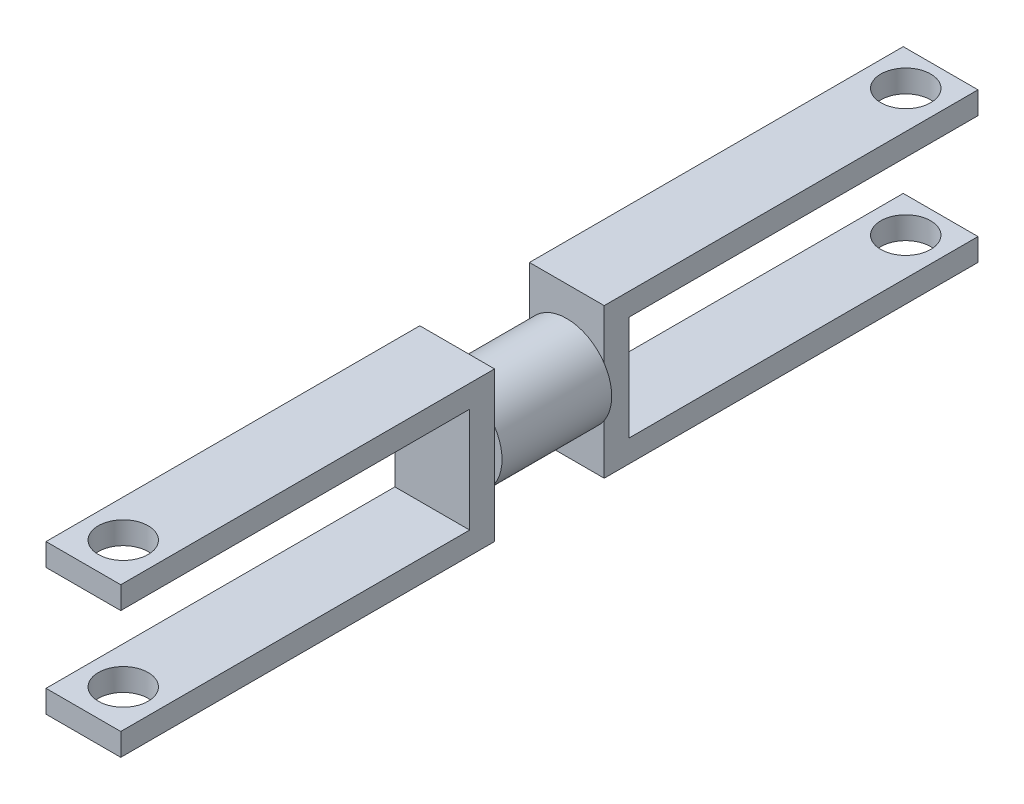
ISO-10303-21;
HEADER;
FILE_DESCRIPTION(('STEP AP214'),'2;1');
FILE_NAME('part.step','',(''),(''),'','','');
FILE_SCHEMA(('AUTOMOTIVE_DESIGN { 1 0 10303 214 1 1 1 1 }'));
ENDSEC;
DATA;
#1=APPLICATION_CONTEXT('core data for automotive mechanical design processes');
#2=APPLICATION_PROTOCOL_DEFINITION('international standard','automotive_design',2000,#1);
#3=PRODUCT_CONTEXT('',#1,'mechanical');
#4=PRODUCT('Part','Part','',(#3));
#5=PRODUCT_RELATED_PRODUCT_CATEGORY('part','',(#4));
#6=PRODUCT_DEFINITION_FORMATION('','',#4);
#7=PRODUCT_DEFINITION_CONTEXT('part definition',#1,'design');
#8=PRODUCT_DEFINITION('design','',#6,#7);
#9=PRODUCT_DEFINITION_SHAPE('','',#8);
#10=(LENGTH_UNIT() NAMED_UNIT(*) SI_UNIT(.MILLI.,.METRE.));
#11=(NAMED_UNIT(*) PLANE_ANGLE_UNIT() SI_UNIT($,.RADIAN.));
#12=(NAMED_UNIT(*) SI_UNIT($,.STERADIAN.) SOLID_ANGLE_UNIT());
#13=UNCERTAINTY_MEASURE_WITH_UNIT(LENGTH_MEASURE(1.E-05),#10,'distance_accuracy_value','');
#14=(GEOMETRIC_REPRESENTATION_CONTEXT(3) GLOBAL_UNCERTAINTY_ASSIGNED_CONTEXT((#13)) GLOBAL_UNIT_ASSIGNED_CONTEXT((#10,
#11,#12)) REPRESENTATION_CONTEXT('',''));
#15=CARTESIAN_POINT('',(0.,0.,0.));
#16=DIRECTION('',(0.,0.,1.));
#17=DIRECTION('',(1.,0.,0.));
#18=AXIS2_PLACEMENT_3D('',#15,#16,#17);
#19=CARTESIAN_POINT('',(0.,0.,38.8));
#20=DIRECTION('',(0.,0.,-1.));
#21=DIRECTION('',(-1.,0.,0.));
#22=AXIS2_PLACEMENT_3D('',#19,#20,#21);
#23=PLANE('',#22);
#24=DIRECTION('',(0.,-1.,0.));
#25=VECTOR('',#24,1.);
#26=CARTESIAN_POINT('',(-3.,-6.,38.8));
#27=LINE('',#26,#25);
#28=CARTESIAN_POINT('',(-3.,6.,38.8));
#29=VERTEX_POINT('',#28);
#30=CARTESIAN_POINT('',(-3.00000000000026,4.19999999999998,38.8));
#31=VERTEX_POINT('',#30);
#32=EDGE_CURVE('E313',#29,#31,#27,.T.);
#33=ORIENTED_EDGE('',*,*,#32,.T.);
#34=DIRECTION('',(-1.,0.,0.));
#35=VECTOR('',#34,1.);
#36=CARTESIAN_POINT('',(-3.00000000000026,4.19999999999998,38.8));
#37=LINE('',#36,#35);
#38=CARTESIAN_POINT('',(3.00000000000026,4.19999999999998,38.8));
#39=VERTEX_POINT('',#38);
#40=EDGE_CURVE('E199',#39,#31,#37,.T.);
#41=ORIENTED_EDGE('',*,*,#40,.F.);
#42=DIRECTION('',(0.,1.,0.));
#43=VECTOR('',#42,1.);
#44=CARTESIAN_POINT('',(3.,-6.,38.8));
#45=LINE('',#44,#43);
#46=CARTESIAN_POINT('',(3.,6.,38.8));
#47=VERTEX_POINT('',#46);
#48=EDGE_CURVE('E310',#39,#47,#45,.T.);
#49=ORIENTED_EDGE('',*,*,#48,.T.);
#50=DIRECTION('',(-1.,0.,0.));
#51=VECTOR('',#50,1.);
#52=CARTESIAN_POINT('',(-3.,6.,38.8));
#53=LINE('',#52,#51);
#54=EDGE_CURVE('E309',#47,#29,#53,.T.);
#55=ORIENTED_EDGE('',*,*,#54,.T.);
#56=EDGE_LOOP('',(#33,#41,#49,#55));
#57=FACE_BOUND('',#56,.T.);
#58=ADVANCED_FACE('F39',(#57),#23,.F.);
#59=CARTESIAN_POINT('',(0.,-24.,35.6));
#60=DIRECTION('',(0.,1.,0.));
#61=DIRECTION('',(0.,0.,1.));
#62=AXIS2_PLACEMENT_3D('',#59,#60,#61);
#63=CYLINDRICAL_SURFACE('',#62,2.);
#64=CARTESIAN_POINT('',(0.,4.19999999999998,35.6));
#65=DIRECTION('',(0.,1.,0.));
#66=DIRECTION('',(0.,0.,1.));
#67=AXIS2_PLACEMENT_3D('',#64,#65,#66);
#68=CIRCLE('',#67,2.);
#69=CARTESIAN_POINT('',(0.,4.19999999999998,37.6));
#70=VERTEX_POINT('',#69);
#71=EDGE_CURVE('E43',#70,#70,#68,.F.);
#72=ORIENTED_EDGE('',*,*,#71,.T.);
#73=EDGE_LOOP('',(#72));
#74=FACE_BOUND('',#73,.T.);
#75=CARTESIAN_POINT('',(0.,6.,35.6));
#76=DIRECTION('',(0.,1.,0.));
#77=DIRECTION('',(0.,0.,1.));
#78=AXIS2_PLACEMENT_3D('',#75,#76,#77);
#79=CIRCLE('',#78,2.);
#80=CARTESIAN_POINT('',(0.,6.,37.6));
#81=VERTEX_POINT('',#80);
#82=EDGE_CURVE('E249',#81,#81,#79,.T.);
#83=ORIENTED_EDGE('',*,*,#82,.T.);
#84=EDGE_LOOP('',(#83));
#85=FACE_BOUND('',#84,.T.);
#86=ADVANCED_FACE('F494',(#74,#85),#63,.F.);
#87=CARTESIAN_POINT('',(0.,0.,-30.));
#88=DIRECTION('',(0.,0.,-1.));
#89=DIRECTION('',(-1.,0.,0.));
#90=AXIS2_PLACEMENT_3D('',#87,#88,#89);
#91=PLANE('',#90);
#92=DIRECTION('',(1.,0.,0.));
#93=VECTOR('',#92,1.);
#94=CARTESIAN_POINT('',(3.,4.2,-30.));
#95=LINE('',#94,#93);
#96=CARTESIAN_POINT('',(-3.,4.2,-30.));
#97=VERTEX_POINT('',#96);
#98=CARTESIAN_POINT('',(3.,4.2,-30.));
#99=VERTEX_POINT('',#98);
#100=EDGE_CURVE('E219',#97,#99,#95,.T.);
#101=ORIENTED_EDGE('',*,*,#100,.F.);
#102=DIRECTION('',(0.,1.,0.));
#103=VECTOR('',#102,1.);
#104=CARTESIAN_POINT('',(-3.,6.,-30.));
#105=LINE('',#104,#103);
#106=CARTESIAN_POINT('',(-3.,6.,-30.));
#107=VERTEX_POINT('',#106);
#108=EDGE_CURVE('E264',#97,#107,#105,.T.);
#109=ORIENTED_EDGE('',*,*,#108,.T.);
#110=DIRECTION('',(1.,0.,0.));
#111=VECTOR('',#110,1.);
#112=CARTESIAN_POINT('',(3.,6.,-30.));
#113=LINE('',#112,#111);
#114=CARTESIAN_POINT('',(3.,6.,-30.));
#115=VERTEX_POINT('',#114);
#116=EDGE_CURVE('E263',#107,#115,#113,.T.);
#117=ORIENTED_EDGE('',*,*,#116,.T.);
#118=DIRECTION('',(0.,-1.,0.));
#119=VECTOR('',#118,1.);
#120=CARTESIAN_POINT('',(3.,6.,-30.));
#121=LINE('',#120,#119);
#122=EDGE_CURVE('E268',#115,#99,#121,.T.);
#123=ORIENTED_EDGE('',*,*,#122,.T.);
#124=EDGE_LOOP('',(#101,#109,#117,#123));
#125=FACE_BOUND('',#124,.T.);
#126=ADVANCED_FACE('F431',(#125),#91,.T.);
#127=CARTESIAN_POINT('',(0.,-24.,-27.2));
#128=DIRECTION('',(0.,1.,0.));
#129=DIRECTION('',(0.,0.,1.));
#130=AXIS2_PLACEMENT_3D('',#127,#128,#129);
#131=CYLINDRICAL_SURFACE('',#130,2.);
#132=CARTESIAN_POINT('',(0.,4.2,-27.2));
#133=DIRECTION('',(0.,1.,0.));
#134=DIRECTION('',(0.,0.,1.));
#135=AXIS2_PLACEMENT_3D('',#132,#133,#134);
#136=CIRCLE('',#135,2.);
#137=CARTESIAN_POINT('',(0.,4.2,-25.2));
#138=VERTEX_POINT('',#137);
#139=EDGE_CURVE('E258',#138,#138,#136,.F.);
#140=ORIENTED_EDGE('',*,*,#139,.T.);
#141=EDGE_LOOP('',(#140));
#142=FACE_BOUND('',#141,.T.);
#143=CARTESIAN_POINT('',(0.,6.,-27.2));
#144=DIRECTION('',(0.,1.,0.));
#145=DIRECTION('',(0.,0.,1.));
#146=AXIS2_PLACEMENT_3D('',#143,#144,#145);
#147=CIRCLE('',#146,2.);
#148=CARTESIAN_POINT('',(0.,6.,-25.2));
#149=VERTEX_POINT('',#148);
#150=EDGE_CURVE('E254',#149,#149,#147,.T.);
#151=ORIENTED_EDGE('',*,*,#150,.T.);
#152=EDGE_LOOP('',(#151));
#153=FACE_BOUND('',#152,.T.);
#154=ADVANCED_FACE('F597',(#142,#153),#131,.F.);
#155=CARTESIAN_POINT('',(0.,0.,0.));
#156=DIRECTION('',(0.,0.,1.));
#157=DIRECTION('',(1.,0.,0.));
#158=AXIS2_PLACEMENT_3D('',#155,#156,#157);
#159=PLANE('',#158);
#160=DIRECTION('',(0.,1.,0.));
#161=VECTOR('',#160,1.);
#162=CARTESIAN_POINT('',(-3.,6.,0.));
#163=LINE('',#162,#161);
#164=CARTESIAN_POINT('',(-3.,-1.98997487421324,0.));
#165=VERTEX_POINT('',#164);
#166=CARTESIAN_POINT('',(-3.,1.98997487421324,0.));
#167=VERTEX_POINT('',#166);
#168=EDGE_CURVE('E11',#165,#167,#163,.T.);
#169=ORIENTED_EDGE('',*,*,#168,.F.);
#170=CARTESIAN_POINT('',(0.,0.,0.));
#171=DIRECTION('',(0.,0.,1.));
#172=DIRECTION('',(1.,0.,0.));
#173=AXIS2_PLACEMENT_3D('',#170,#171,#172);
#174=CIRCLE('',#173,3.6);
#175=EDGE_CURVE('E364',#167,#165,#174,.T.);
#176=ORIENTED_EDGE('',*,*,#175,.F.);
#177=EDGE_LOOP('',(#169,#176));
#178=FACE_BOUND('',#177,.T.);
#179=ADVANCED_FACE('F533',(#178),#159,.F.);
#180=DIRECTION('',(0.,-1.,0.));
#181=VECTOR('',#180,1.);
#182=CARTESIAN_POINT('',(3.,6.,0.));
#183=LINE('',#182,#181);
#184=CARTESIAN_POINT('',(3.,1.98997487421324,0.));
#185=VERTEX_POINT('',#184);
#186=CARTESIAN_POINT('',(3.,-1.98997487421324,0.));
#187=VERTEX_POINT('',#186);
#188=EDGE_CURVE('E49',#185,#187,#183,.T.);
#189=ORIENTED_EDGE('',*,*,#188,.F.);
#190=EDGE_CURVE('E353',#187,#185,#174,.T.);
#191=ORIENTED_EDGE('',*,*,#190,.F.);
#192=EDGE_LOOP('',(#189,#191));
#193=FACE_BOUND('',#192,.T.);
#194=ADVANCED_FACE('F527',(#193),#159,.F.);
#195=CARTESIAN_POINT('',(0.,0.,8.8));
#196=DIRECTION('',(0.,0.,1.));
#197=DIRECTION('',(1.,0.,0.));
#198=AXIS2_PLACEMENT_3D('',#195,#196,#197);
#199=PLANE('',#198);
#200=DIRECTION('',(0.,1.,0.));
#201=VECTOR('',#200,1.);
#202=CARTESIAN_POINT('',(3.,-6.,8.8));
#203=LINE('',#202,#201);
#204=CARTESIAN_POINT('',(3.,-1.98997487421324,8.8));
#205=VERTEX_POINT('',#204);
#206=CARTESIAN_POINT('',(3.,1.98997487421324,8.8));
#207=VERTEX_POINT('',#206);
#208=EDGE_CURVE('E326',#205,#207,#203,.T.);
#209=ORIENTED_EDGE('',*,*,#208,.F.);
#210=CARTESIAN_POINT('',(0.,0.,8.8));
#211=DIRECTION('',(0.,0.,1.));
#212=DIRECTION('',(1.,0.,0.));
#213=AXIS2_PLACEMENT_3D('',#210,#211,#212);
#214=CIRCLE('',#213,3.6);
#215=EDGE_CURVE('E359',#205,#207,#214,.T.);
#216=ORIENTED_EDGE('',*,*,#215,.T.);
#217=EDGE_LOOP('',(#209,#216));
#218=FACE_BOUND('',#217,.T.);
#219=ADVANCED_FACE('F525',(#218),#199,.T.);
#220=CARTESIAN_POINT('',(0.,0.,8.8));
#221=DIRECTION('',(0.,0.,-1.));
#222=DIRECTION('',(-1.,0.,0.));
#223=AXIS2_PLACEMENT_3D('',#220,#221,#222);
#224=CYLINDRICAL_SURFACE('',#223,3.6);
#225=CARTESIAN_POINT('',(-3.,1.98997487421324,8.8));
#226=VERTEX_POINT('',#225);
#227=EDGE_CURVE('E354',#207,#226,#214,.T.);
#228=ORIENTED_EDGE('',*,*,#227,.F.);
#229=ORIENTED_EDGE('',*,*,#215,.F.);
#230=CARTESIAN_POINT('',(-3.,-1.98997487421324,8.8));
#231=VERTEX_POINT('',#230);
#232=EDGE_CURVE('E485',#231,#205,#214,.T.);
#233=ORIENTED_EDGE('',*,*,#232,.F.);
#234=EDGE_CURVE('E358',#226,#231,#214,.T.);
#235=ORIENTED_EDGE('',*,*,#234,.F.);
#236=EDGE_LOOP('',(#228,#229,#233,#235));
#237=FACE_BOUND('',#236,.T.);
#238=EDGE_CURVE('E360',#185,#167,#174,.T.);
#239=ORIENTED_EDGE('',*,*,#238,.T.);
#240=ORIENTED_EDGE('',*,*,#175,.T.);
#241=EDGE_CURVE('E459',#165,#187,#174,.T.);
#242=ORIENTED_EDGE('',*,*,#241,.T.);
#243=ORIENTED_EDGE('',*,*,#190,.T.);
#244=EDGE_LOOP('',(#239,#240,#242,#243));
#245=FACE_BOUND('',#244,.T.);
#246=ADVANCED_FACE('F41',(#237,#245),#224,.T.);
#247=DIRECTION('',(0.,-1.,0.));
#248=VECTOR('',#247,1.);
#249=CARTESIAN_POINT('',(-3.,-6.,8.8));
#250=LINE('',#249,#248);
#251=EDGE_CURVE('E335',#226,#231,#250,.T.);
#252=ORIENTED_EDGE('',*,*,#251,.F.);
#253=ORIENTED_EDGE('',*,*,#234,.T.);
#254=EDGE_LOOP('',(#252,#253));
#255=FACE_BOUND('',#254,.T.);
#256=ADVANCED_FACE('F478',(#255),#199,.T.);
#257=CARTESIAN_POINT('',(0.,0.,8.8));
#258=DIRECTION('',(0.,0.,-1.));
#259=DIRECTION('',(-1.,0.,0.));
#260=AXIS2_PLACEMENT_3D('',#257,#258,#259);
#261=PLANE('',#260);
#262=CARTESIAN_POINT('',(3.,6.,8.8));
#263=VERTEX_POINT('',#262);
#264=EDGE_CURVE('E304',#207,#263,#203,.T.);
#265=ORIENTED_EDGE('',*,*,#264,.F.);
#266=ORIENTED_EDGE('',*,*,#227,.T.);
#267=CARTESIAN_POINT('',(-3.,6.,8.8));
#268=VERTEX_POINT('',#267);
#269=EDGE_CURVE('E330',#268,#226,#250,.T.);
#270=ORIENTED_EDGE('',*,*,#269,.F.);
#271=DIRECTION('',(-1.,0.,0.));
#272=VECTOR('',#271,1.);
#273=CARTESIAN_POINT('',(-3.,6.,8.8));
#274=LINE('',#273,#272);
#275=EDGE_CURVE('E325',#263,#268,#274,.T.);
#276=ORIENTED_EDGE('',*,*,#275,.F.);
#277=EDGE_LOOP('',(#265,#266,#270,#276));
#278=FACE_BOUND('',#277,.T.);
#279=ADVANCED_FACE('F488',(#278),#261,.T.);
#280=CARTESIAN_POINT('',(3.,-6.,38.8));
#281=DIRECTION('',(-1.,0.,0.));
#282=DIRECTION('',(0.,0.,1.));
#283=AXIS2_PLACEMENT_3D('',#280,#281,#282);
#284=PLANE('',#283);
#285=ORIENTED_EDGE('',*,*,#48,.F.);
#286=DIRECTION('',(0.,0.,1.));
#287=VECTOR('',#286,1.);
#288=CARTESIAN_POINT('',(3.00000000000026,4.19999999999998,10.8));
#289=LINE('',#288,#287);
#290=CARTESIAN_POINT('',(3.00000000000026,4.19999999999998,10.8));
#291=VERTEX_POINT('',#290);
#292=EDGE_CURVE('E209',#291,#39,#289,.T.);
#293=ORIENTED_EDGE('',*,*,#292,.F.);
#294=DIRECTION('',(0.,1.,0.));
#295=VECTOR('',#294,1.);
#296=CARTESIAN_POINT('',(3.00000000000026,-4.19999999999998,10.8));
#297=LINE('',#296,#295);
#298=CARTESIAN_POINT('',(3.00000000000026,-4.19999999999998,10.8));
#299=VERTEX_POINT('',#298);
#300=EDGE_CURVE('E188',#299,#291,#297,.T.);
#301=ORIENTED_EDGE('',*,*,#300,.F.);
#302=DIRECTION('',(0.,0.,1.));
#303=VECTOR('',#302,1.);
#304=CARTESIAN_POINT('',(3.00000000000026,-4.19999999999998,10.8));
#305=LINE('',#304,#303);
#306=CARTESIAN_POINT('',(3.00000000000026,-4.19999999999998,38.8));
#307=VERTEX_POINT('',#306);
#308=EDGE_CURVE('E184',#299,#307,#305,.T.);
#309=ORIENTED_EDGE('',*,*,#308,.T.);
#310=CARTESIAN_POINT('',(3.,-6.,38.8));
#311=VERTEX_POINT('',#310);
#312=EDGE_CURVE('E305',#311,#307,#45,.T.);
#313=ORIENTED_EDGE('',*,*,#312,.F.);
#314=DIRECTION('',(0.,0.,-1.));
#315=VECTOR('',#314,1.);
#316=CARTESIAN_POINT('',(3.,-6.,38.8));
#317=LINE('',#316,#315);
#318=CARTESIAN_POINT('',(3.,-6.,8.8));
#319=VERTEX_POINT('',#318);
#320=EDGE_CURVE('E320',#311,#319,#317,.T.);
#321=ORIENTED_EDGE('',*,*,#320,.T.);
#322=EDGE_CURVE('E321',#319,#205,#203,.T.);
#323=ORIENTED_EDGE('',*,*,#322,.T.);
#324=ORIENTED_EDGE('',*,*,#208,.T.);
#325=ORIENTED_EDGE('',*,*,#264,.T.);
#326=DIRECTION('',(0.,0.,-1.));
#327=VECTOR('',#326,1.);
#328=CARTESIAN_POINT('',(3.,6.,38.8));
#329=LINE('',#328,#327);
#330=EDGE_CURVE('E349',#47,#263,#329,.T.);
#331=ORIENTED_EDGE('',*,*,#330,.F.);
#332=EDGE_LOOP('',(#285,#293,#301,#309,#313,#321,#323,#324,#325,#331));
#333=FACE_BOUND('',#332,.T.);
#334=ADVANCED_FACE('F403',(#333),#284,.F.);
#335=CARTESIAN_POINT('',(-3.,6.,38.8));
#336=DIRECTION('',(0.,-1.,0.));
#337=DIRECTION('',(0.,0.,-1.));
#338=AXIS2_PLACEMENT_3D('',#335,#336,#337);
#339=PLANE('',#338);
#340=ORIENTED_EDGE('',*,*,#82,.F.);
#341=EDGE_LOOP('',(#340));
#342=FACE_BOUND('',#341,.T.);
#343=ORIENTED_EDGE('',*,*,#275,.T.);
#344=DIRECTION('',(0.,0.,-1.));
#345=VECTOR('',#344,1.);
#346=CARTESIAN_POINT('',(-3.,6.,38.8));
#347=LINE('',#346,#345);
#348=EDGE_CURVE('E345',#29,#268,#347,.T.);
#349=ORIENTED_EDGE('',*,*,#348,.F.);
#350=ORIENTED_EDGE('',*,*,#54,.F.);
#351=ORIENTED_EDGE('',*,*,#330,.T.);
#352=EDGE_LOOP('',(#343,#349,#350,#351));
#353=FACE_BOUND('',#352,.T.);
#354=ADVANCED_FACE('F492',(#342,#353),#339,.F.);
#355=CARTESIAN_POINT('',(-3.,-6.,38.8));
#356=DIRECTION('',(1.,0.,0.));
#357=DIRECTION('',(0.,0.,-1.));
#358=AXIS2_PLACEMENT_3D('',#355,#356,#357);
#359=PLANE('',#358);
#360=DIRECTION('',(0.,-1.,0.));
#361=VECTOR('',#360,1.);
#362=CARTESIAN_POINT('',(-3.00000000000026,-4.19999999999998,10.8));
#363=LINE('',#362,#361);
#364=CARTESIAN_POINT('',(-3.00000000000026,4.19999999999998,10.8));
#365=VERTEX_POINT('',#364);
#366=CARTESIAN_POINT('',(-3.00000000000026,-4.19999999999998,10.8));
#367=VERTEX_POINT('',#366);
#368=EDGE_CURVE('E189',#365,#367,#363,.T.);
#369=ORIENTED_EDGE('',*,*,#368,.F.);
#370=DIRECTION('',(0.,0.,1.));
#371=VECTOR('',#370,1.);
#372=CARTESIAN_POINT('',(-3.00000000000026,4.19999999999998,10.8));
#373=LINE('',#372,#371);
#374=EDGE_CURVE('E380',#365,#31,#373,.T.);
#375=ORIENTED_EDGE('',*,*,#374,.T.);
#376=ORIENTED_EDGE('',*,*,#32,.F.);
#377=ORIENTED_EDGE('',*,*,#348,.T.);
#378=ORIENTED_EDGE('',*,*,#269,.T.);
#379=ORIENTED_EDGE('',*,*,#251,.T.);
#380=CARTESIAN_POINT('',(-3.,-6.,8.8));
#381=VERTEX_POINT('',#380);
#382=EDGE_CURVE('E329',#231,#381,#250,.T.);
#383=ORIENTED_EDGE('',*,*,#382,.T.);
#384=DIRECTION('',(0.,0.,-1.));
#385=VECTOR('',#384,1.);
#386=CARTESIAN_POINT('',(-3.,-6.,38.8));
#387=LINE('',#386,#385);
#388=CARTESIAN_POINT('',(-3.,-6.,38.8));
#389=VERTEX_POINT('',#388);
#390=EDGE_CURVE('E341',#389,#381,#387,.T.);
#391=ORIENTED_EDGE('',*,*,#390,.F.);
#392=CARTESIAN_POINT('',(-3.,-4.19999999999998,38.8));
#393=VERTEX_POINT('',#392);
#394=EDGE_CURVE('E204',#393,#389,#27,.T.);
#395=ORIENTED_EDGE('',*,*,#394,.F.);
#396=DIRECTION('',(0.,0.,1.));
#397=VECTOR('',#396,1.);
#398=CARTESIAN_POINT('',(-3.00000000000026,-4.19999999999998,10.8));
#399=LINE('',#398,#397);
#400=EDGE_CURVE('E59',#367,#393,#399,.T.);
#401=ORIENTED_EDGE('',*,*,#400,.F.);
#402=EDGE_LOOP('',(#369,#375,#376,#377,#378,#379,#383,#391,#395,#401));
#403=FACE_BOUND('',#402,.T.);
#404=ADVANCED_FACE('F202',(#403),#359,.F.);
#405=CARTESIAN_POINT('',(-3.,-6.,38.8));
#406=DIRECTION('',(0.,1.,0.));
#407=DIRECTION('',(0.,0.,1.));
#408=AXIS2_PLACEMENT_3D('',#405,#406,#407);
#409=PLANE('',#408);
#410=CARTESIAN_POINT('',(0.,-6.,35.6));
#411=DIRECTION('',(0.,1.,0.));
#412=DIRECTION('',(0.,0.,1.));
#413=AXIS2_PLACEMENT_3D('',#410,#411,#412);
#414=CIRCLE('',#413,2.);
#415=CARTESIAN_POINT('',(0.,-6.,37.6));
#416=VERTEX_POINT('',#415);
#417=EDGE_CURVE('E368',#416,#416,#414,.T.);
#418=ORIENTED_EDGE('',*,*,#417,.T.);
#419=EDGE_LOOP('',(#418));
#420=FACE_BOUND('',#419,.T.);
#421=DIRECTION('',(1.,0.,0.));
#422=VECTOR('',#421,1.);
#423=CARTESIAN_POINT('',(-3.,-6.,8.8));
#424=LINE('',#423,#422);
#425=EDGE_CURVE('E334',#381,#319,#424,.T.);
#426=ORIENTED_EDGE('',*,*,#425,.T.);
#427=ORIENTED_EDGE('',*,*,#320,.F.);
#428=DIRECTION('',(1.,0.,0.));
#429=VECTOR('',#428,1.);
#430=CARTESIAN_POINT('',(-3.,-6.,38.8));
#431=LINE('',#430,#429);
#432=EDGE_CURVE('E317',#389,#311,#431,.T.);
#433=ORIENTED_EDGE('',*,*,#432,.F.);
#434=ORIENTED_EDGE('',*,*,#390,.T.);
#435=EDGE_LOOP('',(#426,#427,#433,#434));
#436=FACE_BOUND('',#435,.T.);
#437=ADVANCED_FACE('F507',(#420,#436),#409,.F.);
#438=ORIENTED_EDGE('',*,*,#312,.T.);
#439=DIRECTION('',(1.,0.,0.));
#440=VECTOR('',#439,1.);
#441=CARTESIAN_POINT('',(-3.00000000000026,-4.19999999999998,38.8));
#442=LINE('',#441,#440);
#443=EDGE_CURVE('E392',#393,#307,#442,.T.);
#444=ORIENTED_EDGE('',*,*,#443,.F.);
#445=ORIENTED_EDGE('',*,*,#394,.T.);
#446=ORIENTED_EDGE('',*,*,#432,.T.);
#447=EDGE_LOOP('',(#438,#444,#445,#446));
#448=FACE_BOUND('',#447,.T.);
#449=ADVANCED_FACE('F496',(#448),#23,.F.);
#450=ORIENTED_EDGE('',*,*,#382,.F.);
#451=ORIENTED_EDGE('',*,*,#232,.T.);
#452=ORIENTED_EDGE('',*,*,#322,.F.);
#453=ORIENTED_EDGE('',*,*,#425,.F.);
#454=EDGE_LOOP('',(#450,#451,#452,#453));
#455=FACE_BOUND('',#454,.T.);
#456=ADVANCED_FACE('F506',(#455),#261,.T.);
#457=CARTESIAN_POINT('',(0.,0.,0.));
#458=DIRECTION('',(0.,0.,-1.));
#459=DIRECTION('',(-1.,0.,0.));
#460=AXIS2_PLACEMENT_3D('',#457,#458,#459);
#461=PLANE('',#460);
#462=ORIENTED_EDGE('',*,*,#238,.F.);
#463=CARTESIAN_POINT('',(3.,6.,0.));
#464=VERTEX_POINT('',#463);
#465=EDGE_CURVE('E282',#464,#185,#183,.T.);
#466=ORIENTED_EDGE('',*,*,#465,.F.);
#467=DIRECTION('',(1.,0.,0.));
#468=VECTOR('',#467,1.);
#469=CARTESIAN_POINT('',(3.,6.,0.));
#470=LINE('',#469,#468);
#471=CARTESIAN_POINT('',(-3.,6.,0.));
#472=VERTEX_POINT('',#471);
#473=EDGE_CURVE('E278',#472,#464,#470,.T.);
#474=ORIENTED_EDGE('',*,*,#473,.F.);
#475=EDGE_CURVE('E52',#167,#472,#163,.T.);
#476=ORIENTED_EDGE('',*,*,#475,.F.);
#477=EDGE_LOOP('',(#462,#466,#474,#476));
#478=FACE_BOUND('',#477,.T.);
#479=ADVANCED_FACE('F423',(#478),#461,.F.);
#480=CARTESIAN_POINT('',(-3.,6.,-30.));
#481=DIRECTION('',(1.,0.,0.));
#482=DIRECTION('',(0.,0.,-1.));
#483=AXIS2_PLACEMENT_3D('',#480,#481,#482);
#484=PLANE('',#483);
#485=ORIENTED_EDGE('',*,*,#108,.F.);
#486=DIRECTION('',(0.,0.,-1.));
#487=VECTOR('',#486,1.);
#488=CARTESIAN_POINT('',(-3.,4.2,-2.));
#489=LINE('',#488,#487);
#490=CARTESIAN_POINT('',(-3.,4.2,-2.));
#491=VERTEX_POINT('',#490);
#492=EDGE_CURVE('E240',#491,#97,#489,.T.);
#493=ORIENTED_EDGE('',*,*,#492,.F.);
#494=DIRECTION('',(0.,1.,0.));
#495=VECTOR('',#494,1.);
#496=CARTESIAN_POINT('',(-3.,-4.2,-2.));
#497=LINE('',#496,#495);
#498=CARTESIAN_POINT('',(-3.,-4.2,-2.));
#499=VERTEX_POINT('',#498);
#500=EDGE_CURVE('E223',#499,#491,#497,.T.);
#501=ORIENTED_EDGE('',*,*,#500,.F.);
#502=DIRECTION('',(0.,0.,-1.));
#503=VECTOR('',#502,1.);
#504=CARTESIAN_POINT('',(-3.,-4.2,-2.));
#505=LINE('',#504,#503);
#506=CARTESIAN_POINT('',(-3.,-4.2,-30.));
#507=VERTEX_POINT('',#506);
#508=EDGE_CURVE('E243',#499,#507,#505,.T.);
#509=ORIENTED_EDGE('',*,*,#508,.T.);
#510=CARTESIAN_POINT('',(-3.,-6.,-30.));
#511=VERTEX_POINT('',#510);
#512=EDGE_CURVE('E259',#511,#507,#105,.T.);
#513=ORIENTED_EDGE('',*,*,#512,.F.);
#514=DIRECTION('',(0.,0.,1.));
#515=VECTOR('',#514,1.);
#516=CARTESIAN_POINT('',(-3.,-6.,-30.));
#517=LINE('',#516,#515);
#518=CARTESIAN_POINT('',(-3.,-6.,0.));
#519=VERTEX_POINT('',#518);
#520=EDGE_CURVE('E274',#511,#519,#517,.T.);
#521=ORIENTED_EDGE('',*,*,#520,.T.);
#522=EDGE_CURVE('E51',#519,#165,#163,.T.);
#523=ORIENTED_EDGE('',*,*,#522,.T.);
#524=ORIENTED_EDGE('',*,*,#168,.T.);
#525=ORIENTED_EDGE('',*,*,#475,.T.);
#526=DIRECTION('',(0.,0.,1.));
#527=VECTOR('',#526,1.);
#528=CARTESIAN_POINT('',(-3.,6.,-30.));
#529=LINE('',#528,#527);
#530=EDGE_CURVE('E300',#107,#472,#529,.T.);
#531=ORIENTED_EDGE('',*,*,#530,.F.);
#532=EDGE_LOOP('',(#485,#493,#501,#509,#513,#521,#523,#524,#525,#531));
#533=FACE_BOUND('',#532,.T.);
#534=ADVANCED_FACE('F419',(#533),#484,.F.);
#535=CARTESIAN_POINT('',(3.,6.,-30.));
#536=DIRECTION('',(0.,-1.,0.));
#537=DIRECTION('',(0.,0.,-1.));
#538=AXIS2_PLACEMENT_3D('',#535,#536,#537);
#539=PLANE('',#538);
#540=ORIENTED_EDGE('',*,*,#150,.F.);
#541=EDGE_LOOP('',(#540));
#542=FACE_BOUND('',#541,.T.);
#543=ORIENTED_EDGE('',*,*,#473,.T.);
#544=DIRECTION('',(0.,0.,1.));
#545=VECTOR('',#544,1.);
#546=CARTESIAN_POINT('',(3.,6.,-30.));
#547=LINE('',#546,#545);
#548=EDGE_CURVE('E296',#115,#464,#547,.T.);
#549=ORIENTED_EDGE('',*,*,#548,.F.);
#550=ORIENTED_EDGE('',*,*,#116,.F.);
#551=ORIENTED_EDGE('',*,*,#530,.T.);
#552=EDGE_LOOP('',(#543,#549,#550,#551));
#553=FACE_BOUND('',#552,.T.);
#554=ADVANCED_FACE('F427',(#542,#553),#539,.F.);
#555=CARTESIAN_POINT('',(3.,6.,-30.));
#556=DIRECTION('',(-1.,0.,0.));
#557=DIRECTION('',(0.,0.,1.));
#558=AXIS2_PLACEMENT_3D('',#555,#556,#557);
#559=PLANE('',#558);
#560=DIRECTION('',(0.,-1.,0.));
#561=VECTOR('',#560,1.);
#562=CARTESIAN_POINT('',(3.,-4.2,-2.));
#563=LINE('',#562,#561);
#564=CARTESIAN_POINT('',(3.,4.2,-2.));
#565=VERTEX_POINT('',#564);
#566=CARTESIAN_POINT('',(3.,-4.2,-2.));
#567=VERTEX_POINT('',#566);
#568=EDGE_CURVE('E214',#565,#567,#563,.T.);
#569=ORIENTED_EDGE('',*,*,#568,.F.);
#570=DIRECTION('',(0.,0.,-1.));
#571=VECTOR('',#570,1.);
#572=CARTESIAN_POINT('',(3.,4.2,-2.));
#573=LINE('',#572,#571);
#574=EDGE_CURVE('E235',#565,#99,#573,.T.);
#575=ORIENTED_EDGE('',*,*,#574,.T.);
#576=ORIENTED_EDGE('',*,*,#122,.F.);
#577=ORIENTED_EDGE('',*,*,#548,.T.);
#578=ORIENTED_EDGE('',*,*,#465,.T.);
#579=ORIENTED_EDGE('',*,*,#188,.T.);
#580=CARTESIAN_POINT('',(3.,-6.,0.));
#581=VERTEX_POINT('',#580);
#582=EDGE_CURVE('E281',#187,#581,#183,.T.);
#583=ORIENTED_EDGE('',*,*,#582,.T.);
#584=DIRECTION('',(0.,0.,1.));
#585=VECTOR('',#584,1.);
#586=CARTESIAN_POINT('',(3.,-6.,-30.));
#587=LINE('',#586,#585);
#588=CARTESIAN_POINT('',(3.,-6.,-30.));
#589=VERTEX_POINT('',#588);
#590=EDGE_CURVE('E292',#589,#581,#587,.T.);
#591=ORIENTED_EDGE('',*,*,#590,.F.);
#592=CARTESIAN_POINT('',(3.,-4.2,-30.));
#593=VERTEX_POINT('',#592);
#594=EDGE_CURVE('E267',#593,#589,#121,.T.);
#595=ORIENTED_EDGE('',*,*,#594,.F.);
#596=DIRECTION('',(0.,0.,-1.));
#597=VECTOR('',#596,1.);
#598=CARTESIAN_POINT('',(3.,-4.2,-2.));
#599=LINE('',#598,#597);
#600=EDGE_CURVE('E67',#567,#593,#599,.T.);
#601=ORIENTED_EDGE('',*,*,#600,.F.);
#602=EDGE_LOOP('',(#569,#575,#576,#577,#578,#579,#583,#591,#595,#601));
#603=FACE_BOUND('',#602,.T.);
#604=ADVANCED_FACE('F442',(#603),#559,.F.);
#605=CARTESIAN_POINT('',(3.,-6.,-30.));
#606=DIRECTION('',(0.,1.,0.));
#607=DIRECTION('',(0.,0.,1.));
#608=AXIS2_PLACEMENT_3D('',#605,#606,#607);
#609=PLANE('',#608);
#610=CARTESIAN_POINT('',(0.,-6.,-27.2));
#611=DIRECTION('',(0.,1.,0.));
#612=DIRECTION('',(0.,0.,1.));
#613=AXIS2_PLACEMENT_3D('',#610,#611,#612);
#614=CIRCLE('',#613,2.);
#615=CARTESIAN_POINT('',(0.,-6.,-25.2));
#616=VERTEX_POINT('',#615);
#617=EDGE_CURVE('E253',#616,#616,#614,.T.);
#618=ORIENTED_EDGE('',*,*,#617,.T.);
#619=EDGE_LOOP('',(#618));
#620=FACE_BOUND('',#619,.T.);
#621=DIRECTION('',(-1.,0.,0.));
#622=VECTOR('',#621,1.);
#623=CARTESIAN_POINT('',(3.,-6.,0.));
#624=LINE('',#623,#622);
#625=EDGE_CURVE('E286',#581,#519,#624,.T.);
#626=ORIENTED_EDGE('',*,*,#625,.T.);
#627=ORIENTED_EDGE('',*,*,#520,.F.);
#628=DIRECTION('',(-1.,0.,0.));
#629=VECTOR('',#628,1.);
#630=CARTESIAN_POINT('',(3.,-6.,-30.));
#631=LINE('',#630,#629);
#632=EDGE_CURVE('E272',#589,#511,#631,.T.);
#633=ORIENTED_EDGE('',*,*,#632,.F.);
#634=ORIENTED_EDGE('',*,*,#590,.T.);
#635=EDGE_LOOP('',(#626,#627,#633,#634));
#636=FACE_BOUND('',#635,.T.);
#637=ADVANCED_FACE('F581',(#620,#636),#609,.F.);
#638=DIRECTION('',(-1.,0.,0.));
#639=VECTOR('',#638,1.);
#640=CARTESIAN_POINT('',(3.,-4.2,-30.));
#641=LINE('',#640,#639);
#642=EDGE_CURVE('E230',#593,#507,#641,.T.);
#643=ORIENTED_EDGE('',*,*,#642,.F.);
#644=ORIENTED_EDGE('',*,*,#594,.T.);
#645=ORIENTED_EDGE('',*,*,#632,.T.);
#646=ORIENTED_EDGE('',*,*,#512,.T.);
#647=EDGE_LOOP('',(#643,#644,#645,#646));
#648=FACE_BOUND('',#647,.T.);
#649=ADVANCED_FACE('F447',(#648),#91,.T.);
#650=ORIENTED_EDGE('',*,*,#241,.F.);
#651=ORIENTED_EDGE('',*,*,#522,.F.);
#652=ORIENTED_EDGE('',*,*,#625,.F.);
#653=ORIENTED_EDGE('',*,*,#582,.F.);
#654=EDGE_LOOP('',(#650,#651,#652,#653));
#655=FACE_BOUND('',#654,.T.);
#656=ADVANCED_FACE('F457',(#655),#461,.F.);
#657=CARTESIAN_POINT('',(0.,-4.2,-27.2));
#658=DIRECTION('',(0.,-1.,0.));
#659=DIRECTION('',(0.,0.,-1.));
#660=AXIS2_PLACEMENT_3D('',#657,#658,#659);
#661=CIRCLE('',#660,2.);
#662=CARTESIAN_POINT('',(0.,-4.2,-29.2));
#663=VERTEX_POINT('',#662);
#664=EDGE_CURVE('E239',#663,#663,#661,.F.);
#665=ORIENTED_EDGE('',*,*,#664,.T.);
#666=EDGE_LOOP('',(#665));
#667=FACE_BOUND('',#666,.T.);
#668=ORIENTED_EDGE('',*,*,#617,.F.);
#669=EDGE_LOOP('',(#668));
#670=FACE_BOUND('',#669,.T.);
#671=ADVANCED_FACE('F609',(#667,#670),#131,.F.);
#672=CARTESIAN_POINT('',(0.,-4.19999999999998,35.6));
#673=DIRECTION('',(0.,-1.,0.));
#674=DIRECTION('',(0.,0.,-1.));
#675=AXIS2_PLACEMENT_3D('',#672,#673,#674);
#676=CIRCLE('',#675,2.);
#677=CARTESIAN_POINT('',(0.,-4.19999999999998,33.6));
#678=VERTEX_POINT('',#677);
#679=EDGE_CURVE('E377',#678,#678,#676,.F.);
#680=ORIENTED_EDGE('',*,*,#679,.T.);
#681=EDGE_LOOP('',(#680));
#682=FACE_BOUND('',#681,.T.);
#683=ORIENTED_EDGE('',*,*,#417,.F.);
#684=EDGE_LOOP('',(#683));
#685=FACE_BOUND('',#684,.T.);
#686=ADVANCED_FACE('F502',(#682,#685),#63,.F.);
#687=CARTESIAN_POINT('',(3.,4.2,-2.));
#688=DIRECTION('',(0.,1.,0.));
#689=DIRECTION('',(0.,0.,1.));
#690=AXIS2_PLACEMENT_3D('',#687,#688,#689);
#691=PLANE('',#690);
#692=ORIENTED_EDGE('',*,*,#100,.T.);
#693=ORIENTED_EDGE('',*,*,#574,.F.);
#694=DIRECTION('',(1.,0.,0.));
#695=VECTOR('',#694,1.);
#696=CARTESIAN_POINT('',(3.,4.2,-2.));
#697=LINE('',#696,#695);
#698=EDGE_CURVE('E226',#491,#565,#697,.T.);
#699=ORIENTED_EDGE('',*,*,#698,.F.);
#700=ORIENTED_EDGE('',*,*,#492,.T.);
#701=EDGE_LOOP('',(#692,#693,#699,#700));
#702=FACE_BOUND('',#701,.T.);
#703=ORIENTED_EDGE('',*,*,#139,.F.);
#704=EDGE_LOOP('',(#703));
#705=FACE_BOUND('',#704,.T.);
#706=ADVANCED_FACE('F436',(#702,#705),#691,.F.);
#707=CARTESIAN_POINT('',(3.,-4.2,-2.));
#708=DIRECTION('',(0.,-1.,0.));
#709=DIRECTION('',(0.,0.,-1.));
#710=AXIS2_PLACEMENT_3D('',#707,#708,#709);
#711=PLANE('',#710);
#712=ORIENTED_EDGE('',*,*,#642,.T.);
#713=ORIENTED_EDGE('',*,*,#508,.F.);
#714=DIRECTION('',(-1.,0.,0.));
#715=VECTOR('',#714,1.);
#716=CARTESIAN_POINT('',(3.,-4.2,-2.));
#717=LINE('',#716,#715);
#718=EDGE_CURVE('E218',#567,#499,#717,.T.);
#719=ORIENTED_EDGE('',*,*,#718,.F.);
#720=ORIENTED_EDGE('',*,*,#600,.T.);
#721=EDGE_LOOP('',(#712,#713,#719,#720));
#722=FACE_BOUND('',#721,.T.);
#723=ORIENTED_EDGE('',*,*,#664,.F.);
#724=EDGE_LOOP('',(#723));
#725=FACE_BOUND('',#724,.T.);
#726=ADVANCED_FACE('F450',(#722,#725),#711,.F.);
#727=CARTESIAN_POINT('',(0.,0.,-2.));
#728=DIRECTION('',(0.,0.,1.));
#729=DIRECTION('',(1.,0.,0.));
#730=AXIS2_PLACEMENT_3D('',#727,#728,#729);
#731=PLANE('',#730);
#732=ORIENTED_EDGE('',*,*,#568,.T.);
#733=ORIENTED_EDGE('',*,*,#718,.T.);
#734=ORIENTED_EDGE('',*,*,#500,.T.);
#735=ORIENTED_EDGE('',*,*,#698,.T.);
#736=EDGE_LOOP('',(#732,#733,#734,#735));
#737=FACE_BOUND('',#736,.T.);
#738=ADVANCED_FACE('F440',(#737),#731,.F.);
#739=CARTESIAN_POINT('',(-3.00000000000026,4.19999999999998,10.8));
#740=DIRECTION('',(0.,1.,0.));
#741=DIRECTION('',(0.,0.,1.));
#742=AXIS2_PLACEMENT_3D('',#739,#740,#741);
#743=PLANE('',#742);
#744=ORIENTED_EDGE('',*,*,#40,.T.);
#745=ORIENTED_EDGE('',*,*,#374,.F.);
#746=DIRECTION('',(-1.,0.,0.));
#747=VECTOR('',#746,1.);
#748=CARTESIAN_POINT('',(-3.00000000000026,4.19999999999998,10.8));
#749=LINE('',#748,#747);
#750=EDGE_CURVE('E195',#291,#365,#749,.T.);
#751=ORIENTED_EDGE('',*,*,#750,.F.);
#752=ORIENTED_EDGE('',*,*,#292,.T.);
#753=EDGE_LOOP('',(#744,#745,#751,#752));
#754=FACE_BOUND('',#753,.T.);
#755=ORIENTED_EDGE('',*,*,#71,.F.);
#756=EDGE_LOOP('',(#755));
#757=FACE_BOUND('',#756,.T.);
#758=ADVANCED_FACE('F399',(#754,#757),#743,.F.);
#759=CARTESIAN_POINT('',(-3.00000000000026,-4.19999999999998,10.8));
#760=DIRECTION('',(0.,-1.,0.));
#761=DIRECTION('',(0.,0.,-1.));
#762=AXIS2_PLACEMENT_3D('',#759,#760,#761);
#763=PLANE('',#762);
#764=ORIENTED_EDGE('',*,*,#443,.T.);
#765=ORIENTED_EDGE('',*,*,#308,.F.);
#766=DIRECTION('',(1.,0.,0.));
#767=VECTOR('',#766,1.);
#768=CARTESIAN_POINT('',(-3.00000000000026,-4.19999999999998,10.8));
#769=LINE('',#768,#767);
#770=EDGE_CURVE('E179',#367,#299,#769,.T.);
#771=ORIENTED_EDGE('',*,*,#770,.F.);
#772=ORIENTED_EDGE('',*,*,#400,.T.);
#773=EDGE_LOOP('',(#764,#765,#771,#772));
#774=FACE_BOUND('',#773,.T.);
#775=ORIENTED_EDGE('',*,*,#679,.F.);
#776=EDGE_LOOP('',(#775));
#777=FACE_BOUND('',#776,.T.);
#778=ADVANCED_FACE('F181',(#774,#777),#763,.F.);
#779=CARTESIAN_POINT('',(0.,0.,10.8));
#780=DIRECTION('',(0.,0.,-1.));
#781=DIRECTION('',(-1.,0.,0.));
#782=AXIS2_PLACEMENT_3D('',#779,#780,#781);
#783=PLANE('',#782);
#784=ORIENTED_EDGE('',*,*,#368,.T.);
#785=ORIENTED_EDGE('',*,*,#770,.T.);
#786=ORIENTED_EDGE('',*,*,#300,.T.);
#787=ORIENTED_EDGE('',*,*,#750,.T.);
#788=EDGE_LOOP('',(#784,#785,#786,#787));
#789=FACE_BOUND('',#788,.T.);
#790=ADVANCED_FACE('F193',(#789),#783,.F.);
#791=CLOSED_SHELL('',(#58,#86,#126,#154,#179,#194,#219,#246,#256,#279,#334,#354,#404,#437,#449,
#456,#479,#534,#554,#604,#637,#649,#656,#671,#686,#706,#726,#738,#758,#778,#790));
#792=MANIFOLD_SOLID_BREP('B2',#791);
#793=ADVANCED_BREP_SHAPE_REPRESENTATION('',(#18,#792),#14);
#794=SHAPE_DEFINITION_REPRESENTATION(#9,#793);
ENDSEC;
END-ISO-10303-21;
